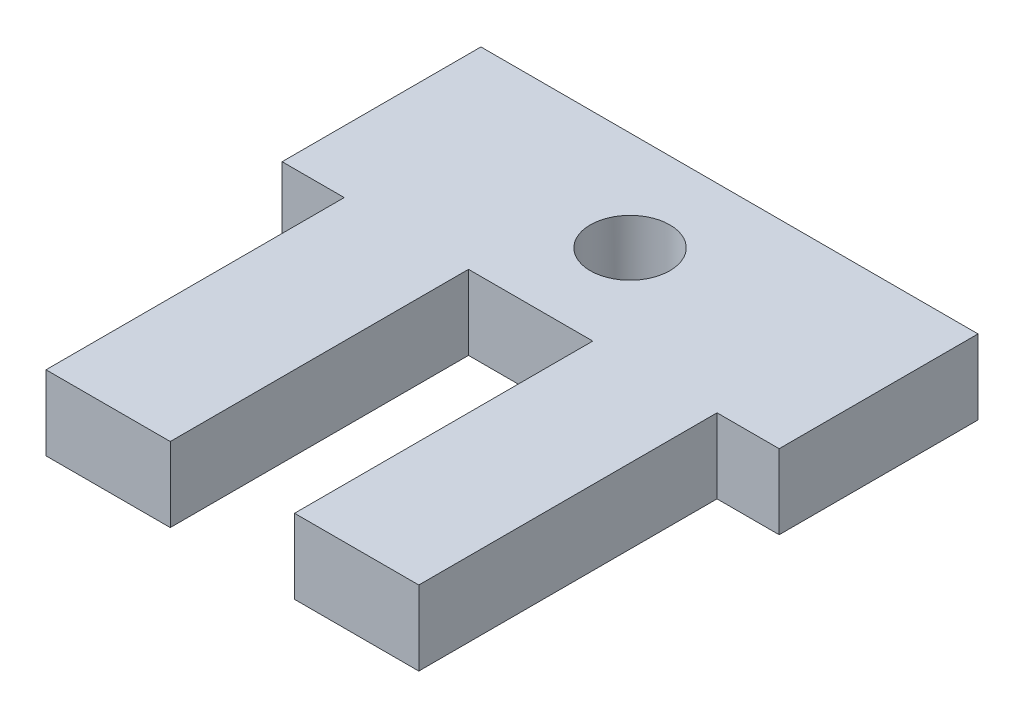
ISO-10303-21;
HEADER;
FILE_DESCRIPTION(('STEP AP214'),'2;1');
FILE_NAME('part.step','',(''),(''),'','','');
FILE_SCHEMA(('AUTOMOTIVE_DESIGN { 1 0 10303 214 1 1 1 1 }'));
ENDSEC;
DATA;
#1=APPLICATION_CONTEXT('core data for automotive mechanical design processes');
#2=APPLICATION_PROTOCOL_DEFINITION('international standard','automotive_design',2000,#1);
#3=PRODUCT_CONTEXT('',#1,'mechanical');
#4=PRODUCT('Part','Part','',(#3));
#5=PRODUCT_RELATED_PRODUCT_CATEGORY('part','',(#4));
#6=PRODUCT_DEFINITION_FORMATION('','',#4);
#7=PRODUCT_DEFINITION_CONTEXT('part definition',#1,'design');
#8=PRODUCT_DEFINITION('design','',#6,#7);
#9=PRODUCT_DEFINITION_SHAPE('','',#8);
#10=(LENGTH_UNIT() NAMED_UNIT(*) SI_UNIT(.MILLI.,.METRE.));
#11=(NAMED_UNIT(*) PLANE_ANGLE_UNIT() SI_UNIT($,.RADIAN.));
#12=(NAMED_UNIT(*) SI_UNIT($,.STERADIAN.) SOLID_ANGLE_UNIT());
#13=UNCERTAINTY_MEASURE_WITH_UNIT(LENGTH_MEASURE(1.E-05),#10,'distance_accuracy_value','');
#14=(GEOMETRIC_REPRESENTATION_CONTEXT(3) GLOBAL_UNCERTAINTY_ASSIGNED_CONTEXT((#13)) GLOBAL_UNIT_ASSIGNED_CONTEXT((#10,
#11,#12)) REPRESENTATION_CONTEXT('',''));
#15=CARTESIAN_POINT('',(0.,0.,0.));
#16=DIRECTION('',(0.,0.,1.));
#17=DIRECTION('',(1.,0.,0.));
#18=AXIS2_PLACEMENT_3D('',#15,#16,#17);
#19=CARTESIAN_POINT('',(0.,3.,0.));
#20=DIRECTION('',(0.,0.,-1.));
#21=DIRECTION('',(-1.,0.,0.));
#22=AXIS2_PLACEMENT_3D('',#19,#20,#21);
#23=PLANE('',#22);
#24=DIRECTION('',(1.,0.,0.));
#25=VECTOR('',#24,1.);
#26=CARTESIAN_POINT('',(0.,3.,0.));
#27=LINE('',#26,#25);
#28=CARTESIAN_POINT('',(12.5,3.,0.));
#29=VERTEX_POINT('',#28);
#30=CARTESIAN_POINT('',(17.5,3.,0.));
#31=VERTEX_POINT('',#30);
#32=EDGE_CURVE('E203',#29,#31,#27,.T.);
#33=ORIENTED_EDGE('',*,*,#32,.F.);
#34=DIRECTION('',(0.,1.,0.));
#35=VECTOR('',#34,1.);
#36=CARTESIAN_POINT('',(12.5,0.,0.));
#37=LINE('',#36,#35);
#38=CARTESIAN_POINT('',(12.5,0.,0.));
#39=VERTEX_POINT('',#38);
#40=EDGE_CURVE('E147',#39,#29,#37,.T.);
#41=ORIENTED_EDGE('',*,*,#40,.F.);
#42=DIRECTION('',(1.,0.,0.));
#43=VECTOR('',#42,1.);
#44=CARTESIAN_POINT('',(0.,0.,0.));
#45=LINE('',#44,#43);
#46=CARTESIAN_POINT('',(17.5,0.,0.));
#47=VERTEX_POINT('',#46);
#48=EDGE_CURVE('E143',#39,#47,#45,.T.);
#49=ORIENTED_EDGE('',*,*,#48,.T.);
#50=DIRECTION('',(0.,1.,0.));
#51=VECTOR('',#50,1.);
#52=CARTESIAN_POINT('',(17.5,-0.00100000000000013,0.));
#53=LINE('',#52,#51);
#54=EDGE_CURVE('E173',#47,#31,#53,.T.);
#55=ORIENTED_EDGE('',*,*,#54,.T.);
#56=EDGE_LOOP('',(#33,#41,#49,#55));
#57=FACE_BOUND('',#56,.T.);
#58=ADVANCED_FACE('F33',(#57),#23,.F.);
#59=CARTESIAN_POINT('',(2.5,0.,0.));
#60=VERTEX_POINT('',#59);
#61=CARTESIAN_POINT('',(7.5,0.,0.));
#62=VERTEX_POINT('',#61);
#63=EDGE_CURVE('E214',#60,#62,#45,.T.);
#64=ORIENTED_EDGE('',*,*,#63,.T.);
#65=DIRECTION('',(0.,1.,0.));
#66=VECTOR('',#65,1.);
#67=CARTESIAN_POINT('',(7.5,0.,0.));
#68=LINE('',#67,#66);
#69=CARTESIAN_POINT('',(7.5,3.,0.));
#70=VERTEX_POINT('',#69);
#71=EDGE_CURVE('E150',#62,#70,#68,.T.);
#72=ORIENTED_EDGE('',*,*,#71,.T.);
#73=CARTESIAN_POINT('',(2.5,3.,0.));
#74=VERTEX_POINT('',#73);
#75=EDGE_CURVE('E205',#74,#70,#27,.T.);
#76=ORIENTED_EDGE('',*,*,#75,.F.);
#77=DIRECTION('',(0.,1.,0.));
#78=VECTOR('',#77,1.);
#79=CARTESIAN_POINT('',(2.5,-0.00100000000000013,0.));
#80=LINE('',#79,#78);
#81=EDGE_CURVE('E192',#60,#74,#80,.T.);
#82=ORIENTED_EDGE('',*,*,#81,.F.);
#83=EDGE_LOOP('',(#64,#72,#76,#82));
#84=FACE_BOUND('',#83,.T.);
#85=ADVANCED_FACE('F253',(#84),#23,.F.);
#86=CARTESIAN_POINT('',(20.,3.,0.));
#87=DIRECTION('',(-1.,0.,0.));
#88=DIRECTION('',(0.,0.,1.));
#89=AXIS2_PLACEMENT_3D('',#86,#87,#88);
#90=PLANE('',#89);
#91=DIRECTION('',(0.,1.,0.));
#92=VECTOR('',#91,1.);
#93=CARTESIAN_POINT('',(20.,-0.00100000000000013,-12.));
#94=LINE('',#93,#92);
#95=CARTESIAN_POINT('',(20.,0.,-12.));
#96=VERTEX_POINT('',#95);
#97=CARTESIAN_POINT('',(20.,3.,-12.));
#98=VERTEX_POINT('',#97);
#99=EDGE_CURVE('E172',#96,#98,#94,.T.);
#100=ORIENTED_EDGE('',*,*,#99,.F.);
#101=DIRECTION('',(0.,0.,-1.));
#102=VECTOR('',#101,1.);
#103=CARTESIAN_POINT('',(20.,0.,0.));
#104=LINE('',#103,#102);
#105=CARTESIAN_POINT('',(20.,0.,-20.));
#106=VERTEX_POINT('',#105);
#107=EDGE_CURVE('E217',#96,#106,#104,.T.);
#108=ORIENTED_EDGE('',*,*,#107,.T.);
#109=DIRECTION('',(0.,-1.,0.));
#110=VECTOR('',#109,1.);
#111=CARTESIAN_POINT('',(20.,3.,-20.));
#112=LINE('',#111,#110);
#113=CARTESIAN_POINT('',(20.,3.,-20.));
#114=VERTEX_POINT('',#113);
#115=EDGE_CURVE('E11',#114,#106,#112,.T.);
#116=ORIENTED_EDGE('',*,*,#115,.F.);
#117=DIRECTION('',(0.,0.,-1.));
#118=VECTOR('',#117,1.);
#119=CARTESIAN_POINT('',(20.,3.,0.));
#120=LINE('',#119,#118);
#121=EDGE_CURVE('E208',#98,#114,#120,.T.);
#122=ORIENTED_EDGE('',*,*,#121,.F.);
#123=EDGE_LOOP('',(#100,#108,#116,#122));
#124=FACE_BOUND('',#123,.T.);
#125=ADVANCED_FACE('F241',(#124),#90,.F.);
#126=CARTESIAN_POINT('',(0.,3.,0.));
#127=DIRECTION('',(0.,-1.,0.));
#128=DIRECTION('',(0.,0.,-1.));
#129=AXIS2_PLACEMENT_3D('',#126,#127,#128);
#130=PLANE('',#129);
#131=CARTESIAN_POINT('',(10.,3.,-16.));
#132=DIRECTION('',(0.,-1.,0.));
#133=DIRECTION('',(0.,0.,-1.));
#134=AXIS2_PLACEMENT_3D('',#131,#132,#133);
#135=CIRCLE('',#134,1.6);
#136=CARTESIAN_POINT('',(10.,3.,-17.6));
#137=VERTEX_POINT('',#136);
#138=EDGE_CURVE('E162',#137,#137,#135,.T.);
#139=ORIENTED_EDGE('',*,*,#138,.T.);
#140=EDGE_LOOP('',(#139));
#141=FACE_BOUND('',#140,.T.);
#142=DIRECTION('',(1.,0.,0.));
#143=VECTOR('',#142,1.);
#144=CARTESIAN_POINT('',(0.,3.,-12.));
#145=LINE('',#144,#143);
#146=CARTESIAN_POINT('',(7.5,3.,-12.));
#147=VERTEX_POINT('',#146);
#148=CARTESIAN_POINT('',(12.5,3.,-12.));
#149=VERTEX_POINT('',#148);
#150=EDGE_CURVE('E149',#147,#149,#145,.T.);
#151=ORIENTED_EDGE('',*,*,#150,.T.);
#152=DIRECTION('',(0.,0.,1.));
#153=VECTOR('',#152,1.);
#154=CARTESIAN_POINT('',(12.5,3.,0.));
#155=LINE('',#154,#153);
#156=EDGE_CURVE('E130',#149,#29,#155,.T.);
#157=ORIENTED_EDGE('',*,*,#156,.T.);
#158=ORIENTED_EDGE('',*,*,#32,.T.);
#159=DIRECTION('',(0.,0.,-1.));
#160=VECTOR('',#159,1.);
#161=CARTESIAN_POINT('',(17.5,3.,-12.));
#162=LINE('',#161,#160);
#163=CARTESIAN_POINT('',(17.5,3.,-12.));
#164=VERTEX_POINT('',#163);
#165=EDGE_CURVE('E169',#31,#164,#162,.T.);
#166=ORIENTED_EDGE('',*,*,#165,.T.);
#167=DIRECTION('',(1.,0.,0.));
#168=VECTOR('',#167,1.);
#169=CARTESIAN_POINT('',(20.,3.,-12.));
#170=LINE('',#169,#168);
#171=EDGE_CURVE('E166',#164,#98,#170,.T.);
#172=ORIENTED_EDGE('',*,*,#171,.T.);
#173=ORIENTED_EDGE('',*,*,#121,.T.);
#174=DIRECTION('',(-1.,0.,0.));
#175=VECTOR('',#174,1.);
#176=CARTESIAN_POINT('',(0.,3.,-20.));
#177=LINE('',#176,#175);
#178=CARTESIAN_POINT('',(0.,3.,-20.));
#179=VERTEX_POINT('',#178);
#180=EDGE_CURVE('E210',#114,#179,#177,.T.);
#181=ORIENTED_EDGE('',*,*,#180,.T.);
#182=DIRECTION('',(0.,0.,1.));
#183=VECTOR('',#182,1.);
#184=CARTESIAN_POINT('',(0.,3.,0.));
#185=LINE('',#184,#183);
#186=CARTESIAN_POINT('',(0.,3.,-12.));
#187=VERTEX_POINT('',#186);
#188=EDGE_CURVE('E200',#179,#187,#185,.T.);
#189=ORIENTED_EDGE('',*,*,#188,.T.);
#190=DIRECTION('',(-1.,0.,0.));
#191=VECTOR('',#190,1.);
#192=CARTESIAN_POINT('',(0.,3.,-12.));
#193=LINE('',#192,#191);
#194=CARTESIAN_POINT('',(2.5,3.,-12.));
#195=VERTEX_POINT('',#194);
#196=EDGE_CURVE('E190',#195,#187,#193,.T.);
#197=ORIENTED_EDGE('',*,*,#196,.F.);
#198=DIRECTION('',(0.,0.,-1.));
#199=VECTOR('',#198,1.);
#200=CARTESIAN_POINT('',(2.5,3.,-12.));
#201=LINE('',#200,#199);
#202=EDGE_CURVE('E187',#74,#195,#201,.T.);
#203=ORIENTED_EDGE('',*,*,#202,.F.);
#204=ORIENTED_EDGE('',*,*,#75,.T.);
#205=DIRECTION('',(0.,0.,-1.));
#206=VECTOR('',#205,1.);
#207=CARTESIAN_POINT('',(7.5,3.,0.));
#208=LINE('',#207,#206);
#209=EDGE_CURVE('E155',#70,#147,#208,.T.);
#210=ORIENTED_EDGE('',*,*,#209,.T.);
#211=EDGE_LOOP('',(#151,#157,#158,#166,#172,#173,#181,#189,#197,#203,#204,#210));
#212=FACE_BOUND('',#211,.T.);
#213=ADVANCED_FACE('F234',(#141,#212),#130,.F.);
#214=CARTESIAN_POINT('',(0.,0.,0.));
#215=DIRECTION('',(0.,-1.,0.));
#216=DIRECTION('',(0.,0.,-1.));
#217=AXIS2_PLACEMENT_3D('',#214,#215,#216);
#218=PLANE('',#217);
#219=DIRECTION('',(0.,0.,-1.));
#220=VECTOR('',#219,1.);
#221=CARTESIAN_POINT('',(12.5,0.,0.));
#222=LINE('',#221,#220);
#223=CARTESIAN_POINT('',(12.5,0.,-12.));
#224=VERTEX_POINT('',#223);
#225=EDGE_CURVE('E127',#39,#224,#222,.T.);
#226=ORIENTED_EDGE('',*,*,#225,.T.);
#227=DIRECTION('',(-1.,0.,0.));
#228=VECTOR('',#227,1.);
#229=CARTESIAN_POINT('',(12.5,0.,-12.));
#230=LINE('',#229,#228);
#231=CARTESIAN_POINT('',(7.5,0.,-12.));
#232=VERTEX_POINT('',#231);
#233=EDGE_CURVE('E136',#224,#232,#230,.T.);
#234=ORIENTED_EDGE('',*,*,#233,.T.);
#235=DIRECTION('',(0.,0.,1.));
#236=VECTOR('',#235,1.);
#237=CARTESIAN_POINT('',(7.5,0.,0.));
#238=LINE('',#237,#236);
#239=EDGE_CURVE('E48',#232,#62,#238,.T.);
#240=ORIENTED_EDGE('',*,*,#239,.T.);
#241=ORIENTED_EDGE('',*,*,#63,.F.);
#242=DIRECTION('',(0.,0.,-1.));
#243=VECTOR('',#242,1.);
#244=CARTESIAN_POINT('',(2.5,0.,-12.));
#245=LINE('',#244,#243);
#246=CARTESIAN_POINT('',(2.5,0.,-12.));
#247=VERTEX_POINT('',#246);
#248=EDGE_CURVE('E181',#60,#247,#245,.T.);
#249=ORIENTED_EDGE('',*,*,#248,.T.);
#250=DIRECTION('',(-1.,0.,0.));
#251=VECTOR('',#250,1.);
#252=CARTESIAN_POINT('',(0.,0.,-12.));
#253=LINE('',#252,#251);
#254=CARTESIAN_POINT('',(0.,0.,-12.));
#255=VERTEX_POINT('',#254);
#256=EDGE_CURVE('E184',#247,#255,#253,.T.);
#257=ORIENTED_EDGE('',*,*,#256,.T.);
#258=DIRECTION('',(0.,0.,1.));
#259=VECTOR('',#258,1.);
#260=CARTESIAN_POINT('',(0.,0.,0.));
#261=LINE('',#260,#259);
#262=CARTESIAN_POINT('',(0.,0.,-20.));
#263=VERTEX_POINT('',#262);
#264=EDGE_CURVE('E196',#263,#255,#261,.T.);
#265=ORIENTED_EDGE('',*,*,#264,.F.);
#266=DIRECTION('',(-1.,0.,0.));
#267=VECTOR('',#266,1.);
#268=CARTESIAN_POINT('',(0.,0.,-20.));
#269=LINE('',#268,#267);
#270=EDGE_CURVE('E204',#106,#263,#269,.T.);
#271=ORIENTED_EDGE('',*,*,#270,.F.);
#272=ORIENTED_EDGE('',*,*,#107,.F.);
#273=DIRECTION('',(1.,0.,0.));
#274=VECTOR('',#273,1.);
#275=CARTESIAN_POINT('',(20.,0.,-12.));
#276=LINE('',#275,#274);
#277=CARTESIAN_POINT('',(17.5,0.,-12.));
#278=VERTEX_POINT('',#277);
#279=EDGE_CURVE('E176',#278,#96,#276,.T.);
#280=ORIENTED_EDGE('',*,*,#279,.F.);
#281=DIRECTION('',(0.,0.,-1.));
#282=VECTOR('',#281,1.);
#283=CARTESIAN_POINT('',(17.5,0.,-12.));
#284=LINE('',#283,#282);
#285=EDGE_CURVE('E56',#47,#278,#284,.T.);
#286=ORIENTED_EDGE('',*,*,#285,.F.);
#287=ORIENTED_EDGE('',*,*,#48,.F.);
#288=EDGE_LOOP('',(#226,#234,#240,#241,#249,#257,#265,#271,#272,#280,#286,#287));
#289=FACE_BOUND('',#288,.T.);
#290=CARTESIAN_POINT('',(10.,0.,-16.));
#291=DIRECTION('',(0.,1.,0.));
#292=DIRECTION('',(0.,0.,1.));
#293=AXIS2_PLACEMENT_3D('',#290,#291,#292);
#294=CIRCLE('',#293,1.6);
#295=CARTESIAN_POINT('',(10.,0.,-14.4));
#296=VERTEX_POINT('',#295);
#297=EDGE_CURVE('E159',#296,#296,#294,.T.);
#298=ORIENTED_EDGE('',*,*,#297,.T.);
#299=EDGE_LOOP('',(#298));
#300=FACE_BOUND('',#299,.T.);
#301=ADVANCED_FACE('F141',(#289,#300),#218,.T.);
#302=CARTESIAN_POINT('',(0.,3.,0.));
#303=DIRECTION('',(1.,0.,0.));
#304=DIRECTION('',(0.,0.,-1.));
#305=AXIS2_PLACEMENT_3D('',#302,#303,#304);
#306=PLANE('',#305);
#307=ORIENTED_EDGE('',*,*,#264,.T.);
#308=DIRECTION('',(0.,1.,0.));
#309=VECTOR('',#308,1.);
#310=CARTESIAN_POINT('',(0.,-0.00100000000000013,-12.));
#311=LINE('',#310,#309);
#312=EDGE_CURVE('E193',#255,#187,#311,.T.);
#313=ORIENTED_EDGE('',*,*,#312,.T.);
#314=ORIENTED_EDGE('',*,*,#188,.F.);
#315=DIRECTION('',(0.,-1.,0.));
#316=VECTOR('',#315,1.);
#317=CARTESIAN_POINT('',(0.,3.,-20.));
#318=LINE('',#317,#316);
#319=EDGE_CURVE('E41',#179,#263,#318,.T.);
#320=ORIENTED_EDGE('',*,*,#319,.T.);
#321=EDGE_LOOP('',(#307,#313,#314,#320));
#322=FACE_BOUND('',#321,.T.);
#323=ADVANCED_FACE('F35',(#322),#306,.F.);
#324=CARTESIAN_POINT('',(0.,3.,-20.));
#325=DIRECTION('',(0.,0.,1.));
#326=DIRECTION('',(1.,0.,0.));
#327=AXIS2_PLACEMENT_3D('',#324,#325,#326);
#328=PLANE('',#327);
#329=ORIENTED_EDGE('',*,*,#270,.T.);
#330=ORIENTED_EDGE('',*,*,#319,.F.);
#331=ORIENTED_EDGE('',*,*,#180,.F.);
#332=ORIENTED_EDGE('',*,*,#115,.T.);
#333=EDGE_LOOP('',(#329,#330,#331,#332));
#334=FACE_BOUND('',#333,.T.);
#335=ADVANCED_FACE('F238',(#334),#328,.F.);
#336=CARTESIAN_POINT('',(0.,-0.00100000000000013,-12.));
#337=DIRECTION('',(0.,0.,-1.));
#338=DIRECTION('',(-1.,0.,0.));
#339=AXIS2_PLACEMENT_3D('',#336,#337,#338);
#340=PLANE('',#339);
#341=DIRECTION('',(0.,1.,0.));
#342=VECTOR('',#341,1.);
#343=CARTESIAN_POINT('',(2.5,-0.00100000000000013,-12.));
#344=LINE('',#343,#342);
#345=EDGE_CURVE('E197',#247,#195,#344,.T.);
#346=ORIENTED_EDGE('',*,*,#345,.T.);
#347=ORIENTED_EDGE('',*,*,#196,.T.);
#348=ORIENTED_EDGE('',*,*,#312,.F.);
#349=ORIENTED_EDGE('',*,*,#256,.F.);
#350=EDGE_LOOP('',(#346,#347,#348,#349));
#351=FACE_BOUND('',#350,.T.);
#352=ADVANCED_FACE('F231',(#351),#340,.F.);
#353=CARTESIAN_POINT('',(2.5,-0.00100000000000013,-12.));
#354=DIRECTION('',(1.,0.,0.));
#355=DIRECTION('',(0.,0.,-1.));
#356=AXIS2_PLACEMENT_3D('',#353,#354,#355);
#357=PLANE('',#356);
#358=ORIENTED_EDGE('',*,*,#81,.T.);
#359=ORIENTED_EDGE('',*,*,#202,.T.);
#360=ORIENTED_EDGE('',*,*,#345,.F.);
#361=ORIENTED_EDGE('',*,*,#248,.F.);
#362=EDGE_LOOP('',(#358,#359,#360,#361));
#363=FACE_BOUND('',#362,.T.);
#364=ADVANCED_FACE('F256',(#363),#357,.F.);
#365=CARTESIAN_POINT('',(17.5,-0.00100000000000013,-12.));
#366=DIRECTION('',(1.,0.,0.));
#367=DIRECTION('',(0.,0.,-1.));
#368=AXIS2_PLACEMENT_3D('',#365,#366,#367);
#369=PLANE('',#368);
#370=ORIENTED_EDGE('',*,*,#285,.T.);
#371=DIRECTION('',(0.,1.,0.));
#372=VECTOR('',#371,1.);
#373=CARTESIAN_POINT('',(17.5,-0.00100000000000013,-12.));
#374=LINE('',#373,#372);
#375=EDGE_CURVE('E177',#278,#164,#374,.T.);
#376=ORIENTED_EDGE('',*,*,#375,.T.);
#377=ORIENTED_EDGE('',*,*,#165,.F.);
#378=ORIENTED_EDGE('',*,*,#54,.F.);
#379=EDGE_LOOP('',(#370,#376,#377,#378));
#380=FACE_BOUND('',#379,.T.);
#381=ADVANCED_FACE('F247',(#380),#369,.T.);
#382=CARTESIAN_POINT('',(20.,-0.00100000000000013,-12.));
#383=DIRECTION('',(0.,0.,1.));
#384=DIRECTION('',(1.,0.,0.));
#385=AXIS2_PLACEMENT_3D('',#382,#383,#384);
#386=PLANE('',#385);
#387=ORIENTED_EDGE('',*,*,#279,.T.);
#388=ORIENTED_EDGE('',*,*,#99,.T.);
#389=ORIENTED_EDGE('',*,*,#171,.F.);
#390=ORIENTED_EDGE('',*,*,#375,.F.);
#391=EDGE_LOOP('',(#387,#388,#389,#390));
#392=FACE_BOUND('',#391,.T.);
#393=ADVANCED_FACE('F244',(#392),#386,.T.);
#394=CARTESIAN_POINT('',(10.,0.,-16.));
#395=DIRECTION('',(0.,1.,0.));
#396=DIRECTION('',(0.,0.,1.));
#397=AXIS2_PLACEMENT_3D('',#394,#395,#396);
#398=CYLINDRICAL_SURFACE('',#397,1.6);
#399=ORIENTED_EDGE('',*,*,#297,.F.);
#400=EDGE_LOOP('',(#399));
#401=FACE_BOUND('',#400,.T.);
#402=ORIENTED_EDGE('',*,*,#138,.F.);
#403=EDGE_LOOP('',(#402));
#404=FACE_BOUND('',#403,.T.);
#405=ADVANCED_FACE('F282',(#401,#404),#398,.F.);
#406=CARTESIAN_POINT('',(12.5,0.,0.));
#407=DIRECTION('',(1.,0.,0.));
#408=DIRECTION('',(0.,0.,-1.));
#409=AXIS2_PLACEMENT_3D('',#406,#407,#408);
#410=PLANE('',#409);
#411=DIRECTION('',(0.,1.,0.));
#412=VECTOR('',#411,1.);
#413=CARTESIAN_POINT('',(12.5,0.,-12.));
#414=LINE('',#413,#412);
#415=EDGE_CURVE('E123',#224,#149,#414,.T.);
#416=ORIENTED_EDGE('',*,*,#415,.F.);
#417=ORIENTED_EDGE('',*,*,#225,.F.);
#418=ORIENTED_EDGE('',*,*,#40,.T.);
#419=ORIENTED_EDGE('',*,*,#156,.F.);
#420=EDGE_LOOP('',(#416,#417,#418,#419));
#421=FACE_BOUND('',#420,.T.);
#422=ADVANCED_FACE('F125',(#421),#410,.F.);
#423=CARTESIAN_POINT('',(7.5,0.,0.));
#424=DIRECTION('',(-1.,0.,0.));
#425=DIRECTION('',(0.,0.,1.));
#426=AXIS2_PLACEMENT_3D('',#423,#424,#425);
#427=PLANE('',#426);
#428=ORIENTED_EDGE('',*,*,#71,.F.);
#429=ORIENTED_EDGE('',*,*,#239,.F.);
#430=DIRECTION('',(0.,1.,0.));
#431=VECTOR('',#430,1.);
#432=CARTESIAN_POINT('',(7.5,0.,-12.));
#433=LINE('',#432,#431);
#434=EDGE_CURVE('E133',#232,#147,#433,.T.);
#435=ORIENTED_EDGE('',*,*,#434,.T.);
#436=ORIENTED_EDGE('',*,*,#209,.F.);
#437=EDGE_LOOP('',(#428,#429,#435,#436));
#438=FACE_BOUND('',#437,.T.);
#439=ADVANCED_FACE('F250',(#438),#427,.F.);
#440=CARTESIAN_POINT('',(12.5,0.,-12.));
#441=DIRECTION('',(0.,0.,-1.));
#442=DIRECTION('',(-1.,0.,0.));
#443=AXIS2_PLACEMENT_3D('',#440,#441,#442);
#444=PLANE('',#443);
#445=ORIENTED_EDGE('',*,*,#434,.F.);
#446=ORIENTED_EDGE('',*,*,#233,.F.);
#447=ORIENTED_EDGE('',*,*,#415,.T.);
#448=ORIENTED_EDGE('',*,*,#150,.F.);
#449=EDGE_LOOP('',(#445,#446,#447,#448));
#450=FACE_BOUND('',#449,.T.);
#451=ADVANCED_FACE('F137',(#450),#444,.F.);
#452=CLOSED_SHELL('',(#58,#85,#125,#213,#301,#323,#335,#352,#364,#381,#393,#405,#422,#439,#451));
#453=MANIFOLD_SOLID_BREP('B2',#452);
#454=ADVANCED_BREP_SHAPE_REPRESENTATION('',(#18,#453),#14);
#455=SHAPE_DEFINITION_REPRESENTATION(#9,#454);
ENDSEC;
END-ISO-10303-21;
